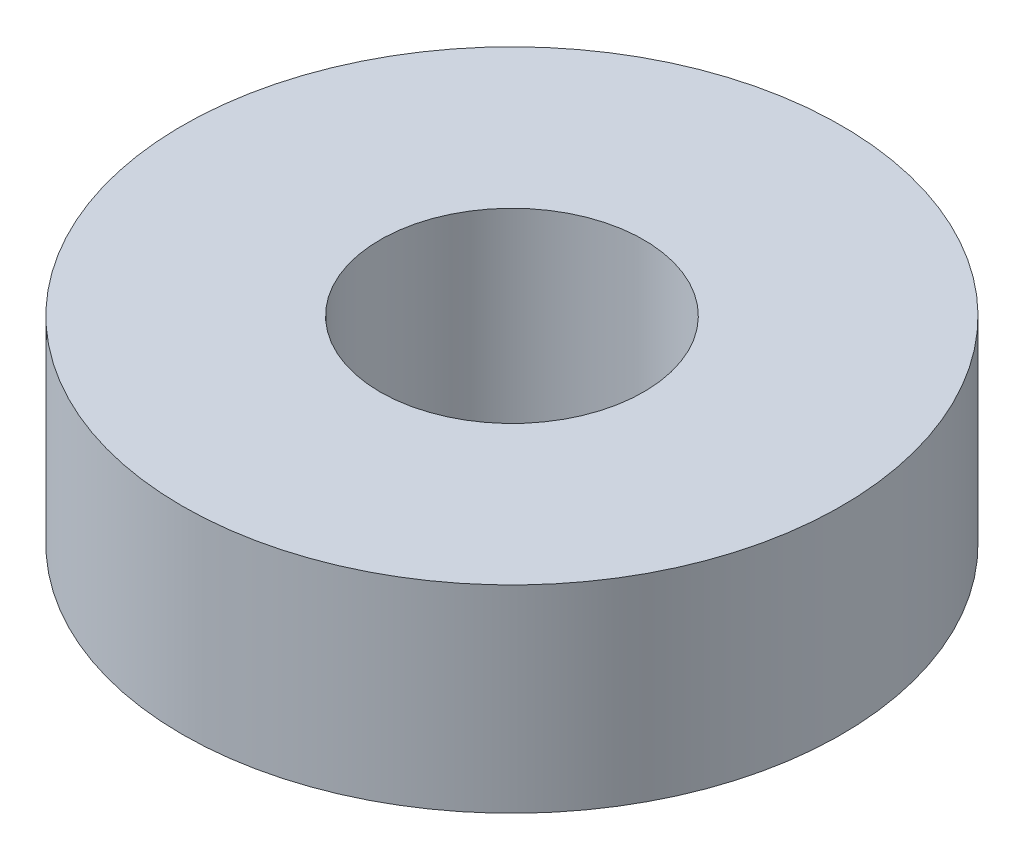
ISO-10303-21;
HEADER;
FILE_DESCRIPTION(('STEP AP214'),'2;1');
FILE_NAME('part.step','',(''),(''),'','','');
FILE_SCHEMA(('AUTOMOTIVE_DESIGN { 1 0 10303 214 1 1 1 1 }'));
ENDSEC;
DATA;
#1=APPLICATION_CONTEXT('core data for automotive mechanical design processes');
#2=APPLICATION_PROTOCOL_DEFINITION('international standard','automotive_design',2000,#1);
#3=PRODUCT_CONTEXT('',#1,'mechanical');
#4=PRODUCT('Part','Part','',(#3));
#5=PRODUCT_RELATED_PRODUCT_CATEGORY('part','',(#4));
#6=PRODUCT_DEFINITION_FORMATION('','',#4);
#7=PRODUCT_DEFINITION_CONTEXT('part definition',#1,'design');
#8=PRODUCT_DEFINITION('design','',#6,#7);
#9=PRODUCT_DEFINITION_SHAPE('','',#8);
#10=(LENGTH_UNIT() NAMED_UNIT(*) SI_UNIT(.MILLI.,.METRE.));
#11=(NAMED_UNIT(*) PLANE_ANGLE_UNIT() SI_UNIT($,.RADIAN.));
#12=(NAMED_UNIT(*) SI_UNIT($,.STERADIAN.) SOLID_ANGLE_UNIT());
#13=UNCERTAINTY_MEASURE_WITH_UNIT(LENGTH_MEASURE(1.E-05),#10,'distance_accuracy_value','');
#14=(GEOMETRIC_REPRESENTATION_CONTEXT(3) GLOBAL_UNCERTAINTY_ASSIGNED_CONTEXT((#13)) GLOBAL_UNIT_ASSIGNED_CONTEXT((#10,
#11,#12)) REPRESENTATION_CONTEXT('',''));
#15=CARTESIAN_POINT('',(0.,0.,0.));
#16=DIRECTION('',(0.,0.,1.));
#17=DIRECTION('',(1.,0.,0.));
#18=AXIS2_PLACEMENT_3D('',#15,#16,#17);
#19=CARTESIAN_POINT('',(0.,4.7625,0.));
#20=DIRECTION('',(0.,-1.,0.));
#21=DIRECTION('',(0.,0.,-1.));
#22=AXIS2_PLACEMENT_3D('',#19,#20,#21);
#23=CYLINDRICAL_SURFACE('',#22,7.9375);
#24=CARTESIAN_POINT('',(0.,4.7625,0.));
#25=DIRECTION('',(0.,1.,0.));
#26=DIRECTION('',(0.,0.,1.));
#27=AXIS2_PLACEMENT_3D('',#24,#25,#26);
#28=CIRCLE('',#27,7.9375);
#29=CARTESIAN_POINT('',(0.,4.7625,7.9375));
#30=VERTEX_POINT('',#29);
#31=EDGE_CURVE('E10',#30,#30,#28,.T.);
#32=ORIENTED_EDGE('',*,*,#31,.F.);
#33=EDGE_LOOP('',(#32));
#34=FACE_BOUND('',#33,.T.);
#35=CARTESIAN_POINT('',(0.,0.,0.));
#36=DIRECTION('',(0.,1.,0.));
#37=DIRECTION('',(0.,0.,1.));
#38=AXIS2_PLACEMENT_3D('',#35,#36,#37);
#39=CIRCLE('',#38,7.9375);
#40=CARTESIAN_POINT('',(0.,0.,7.9375));
#41=VERTEX_POINT('',#40);
#42=EDGE_CURVE('E40',#41,#41,#39,.T.);
#43=ORIENTED_EDGE('',*,*,#42,.T.);
#44=EDGE_LOOP('',(#43));
#45=FACE_BOUND('',#44,.T.);
#46=ADVANCED_FACE('F37',(#34,#45),#23,.T.);
#47=CARTESIAN_POINT('',(0.,4.7625,0.));
#48=DIRECTION('',(0.,1.,0.));
#49=DIRECTION('',(0.,0.,1.));
#50=AXIS2_PLACEMENT_3D('',#47,#48,#49);
#51=PLANE('',#50);
#52=CARTESIAN_POINT('',(0.,4.7625,0.));
#53=DIRECTION('',(0.,1.,0.));
#54=DIRECTION('',(0.,0.,1.));
#55=AXIS2_PLACEMENT_3D('',#52,#53,#54);
#56=CIRCLE('',#55,3.175);
#57=CARTESIAN_POINT('',(0.,4.7625,3.175));
#58=VERTEX_POINT('',#57);
#59=EDGE_CURVE('E51',#58,#58,#56,.T.);
#60=ORIENTED_EDGE('',*,*,#59,.F.);
#61=EDGE_LOOP('',(#60));
#62=FACE_BOUND('',#61,.T.);
#63=ORIENTED_EDGE('',*,*,#31,.T.);
#64=EDGE_LOOP('',(#63));
#65=FACE_BOUND('',#64,.T.);
#66=ADVANCED_FACE('F68',(#62,#65),#51,.T.);
#67=CARTESIAN_POINT('',(0.,0.,0.));
#68=DIRECTION('',(0.,1.,0.));
#69=DIRECTION('',(0.,0.,1.));
#70=AXIS2_PLACEMENT_3D('',#67,#68,#69);
#71=PLANE('',#70);
#72=CARTESIAN_POINT('',(0.,0.,0.));
#73=DIRECTION('',(0.,1.,0.));
#74=DIRECTION('',(0.,0.,1.));
#75=AXIS2_PLACEMENT_3D('',#72,#73,#74);
#76=CIRCLE('',#75,3.175);
#77=CARTESIAN_POINT('',(0.,0.,3.175));
#78=VERTEX_POINT('',#77);
#79=EDGE_CURVE('E49',#78,#78,#76,.T.);
#80=ORIENTED_EDGE('',*,*,#79,.T.);
#81=EDGE_LOOP('',(#80));
#82=FACE_BOUND('',#81,.T.);
#83=ORIENTED_EDGE('',*,*,#42,.F.);
#84=EDGE_LOOP('',(#83));
#85=FACE_BOUND('',#84,.T.);
#86=ADVANCED_FACE('F59',(#82,#85),#71,.F.);
#87=CARTESIAN_POINT('',(0.,0.,0.));
#88=DIRECTION('',(0.,1.,0.));
#89=DIRECTION('',(0.,0.,1.));
#90=AXIS2_PLACEMENT_3D('',#87,#88,#89);
#91=CYLINDRICAL_SURFACE('',#90,3.175);
#92=ORIENTED_EDGE('',*,*,#79,.F.);
#93=EDGE_LOOP('',(#92));
#94=FACE_BOUND('',#93,.T.);
#95=ORIENTED_EDGE('',*,*,#59,.T.);
#96=EDGE_LOOP('',(#95));
#97=FACE_BOUND('',#96,.T.);
#98=ADVANCED_FACE('F62',(#94,#97),#91,.F.);
#99=CLOSED_SHELL('',(#46,#66,#86,#98));
#100=MANIFOLD_SOLID_BREP('B2',#99);
#101=ADVANCED_BREP_SHAPE_REPRESENTATION('',(#18,#100),#14);
#102=SHAPE_DEFINITION_REPRESENTATION(#9,#101);
ENDSEC;
END-ISO-10303-21;
